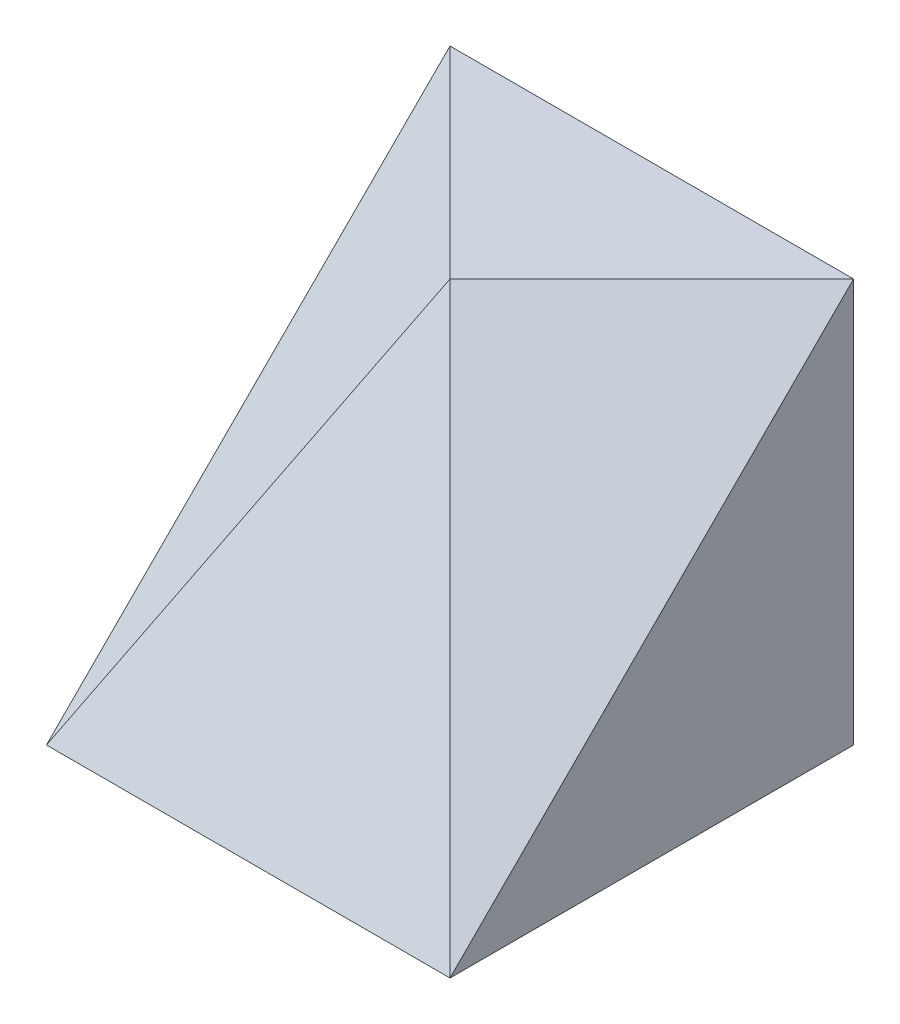
ISO-10303-21;
HEADER;
FILE_DESCRIPTION(('STEP AP214'),'2;1');
FILE_NAME('part.step','',(''),(''),'','','');
FILE_SCHEMA(('AUTOMOTIVE_DESIGN { 1 0 10303 214 1 1 1 1 }'));
ENDSEC;
DATA;
#1=APPLICATION_CONTEXT('core data for automotive mechanical design processes');
#2=APPLICATION_PROTOCOL_DEFINITION('international standard','automotive_design',2000,#1);
#3=PRODUCT_CONTEXT('',#1,'mechanical');
#4=PRODUCT('Part','Part','',(#3));
#5=PRODUCT_RELATED_PRODUCT_CATEGORY('part','',(#4));
#6=PRODUCT_DEFINITION_FORMATION('','',#4);
#7=PRODUCT_DEFINITION_CONTEXT('part definition',#1,'design');
#8=PRODUCT_DEFINITION('design','',#6,#7);
#9=PRODUCT_DEFINITION_SHAPE('','',#8);
#10=(LENGTH_UNIT() NAMED_UNIT(*) SI_UNIT(.MILLI.,.METRE.));
#11=(NAMED_UNIT(*) PLANE_ANGLE_UNIT() SI_UNIT($,.RADIAN.));
#12=(NAMED_UNIT(*) SI_UNIT($,.STERADIAN.) SOLID_ANGLE_UNIT());
#13=UNCERTAINTY_MEASURE_WITH_UNIT(LENGTH_MEASURE(1.E-05),#10,'distance_accuracy_value','');
#14=(GEOMETRIC_REPRESENTATION_CONTEXT(3) GLOBAL_UNCERTAINTY_ASSIGNED_CONTEXT((#13)) GLOBAL_UNIT_ASSIGNED_CONTEXT((#10,
#11,#12)) REPRESENTATION_CONTEXT('',''));
#15=CARTESIAN_POINT('',(0.,0.,0.));
#16=DIRECTION('',(0.,0.,1.));
#17=DIRECTION('',(1.,0.,0.));
#18=AXIS2_PLACEMENT_3D('',#15,#16,#17);
#19=CARTESIAN_POINT('',(0.,4.,0.));
#20=DIRECTION('',(0.,-1.,0.));
#21=DIRECTION('',(0.,0.,-1.));
#22=AXIS2_PLACEMENT_3D('',#19,#20,#21);
#23=PLANE('',#22);
#24=DIRECTION('',(-0.707106781186548,0.,-0.707106781186547));
#25=VECTOR('',#24,1.);
#26=CARTESIAN_POINT('',(0.,4.,0.));
#27=LINE('',#26,#25);
#28=CARTESIAN_POINT('',(0.,4.,0.));
#29=VERTEX_POINT('',#28);
#30=CARTESIAN_POINT('',(-2.00000000000001,4.,-2.00000000000001));
#31=VERTEX_POINT('',#30);
#32=EDGE_CURVE('E84',#29,#31,#27,.T.);
#33=ORIENTED_EDGE('',*,*,#32,.F.);
#34=DIRECTION('',(-0.707106781186546,0.,0.70710678118655));
#35=VECTOR('',#34,1.);
#36=CARTESIAN_POINT('',(1.99999999999999,4.,-2.00000000000001));
#37=LINE('',#36,#35);
#38=CARTESIAN_POINT('',(1.99999999999999,4.,-2.00000000000001));
#39=VERTEX_POINT('',#38);
#40=EDGE_CURVE('E107',#39,#29,#37,.T.);
#41=ORIENTED_EDGE('',*,*,#40,.F.);
#42=DIRECTION('',(-1.,0.,0.));
#43=VECTOR('',#42,1.);
#44=CARTESIAN_POINT('',(-2.00000000000001,4.,-2.00000000000001));
#45=LINE('',#44,#43);
#46=EDGE_CURVE('E98',#39,#31,#45,.T.);
#47=ORIENTED_EDGE('',*,*,#46,.T.);
#48=EDGE_LOOP('',(#33,#41,#47));
#49=FACE_BOUND('',#48,.T.);
#50=ADVANCED_FACE('F36',(#49),#23,.F.);
#51=CARTESIAN_POINT('',(-2.00000000000001,4.,2.));
#52=DIRECTION('',(1.,0.,0.));
#53=DIRECTION('',(0.,0.,-1.));
#54=AXIS2_PLACEMENT_3D('',#51,#52,#53);
#55=PLANE('',#54);
#56=DIRECTION('',(0.,-0.707106781186547,0.707106781186548));
#57=VECTOR('',#56,1.);
#58=CARTESIAN_POINT('',(-2.00000000000001,4.,-2.00000000000001));
#59=LINE('',#58,#57);
#60=CARTESIAN_POINT('',(-2.00000000000001,0.,2.));
#61=VERTEX_POINT('',#60);
#62=EDGE_CURVE('E83',#31,#61,#59,.T.);
#63=ORIENTED_EDGE('',*,*,#62,.F.);
#64=DIRECTION('',(0.,-1.,0.));
#65=VECTOR('',#64,1.);
#66=CARTESIAN_POINT('',(-2.00000000000001,4.,-2.00000000000001));
#67=LINE('',#66,#65);
#68=CARTESIAN_POINT('',(-2.00000000000001,0.,-2.00000000000001));
#69=VERTEX_POINT('',#68);
#70=EDGE_CURVE('E45',#31,#69,#67,.T.);
#71=ORIENTED_EDGE('',*,*,#70,.T.);
#72=DIRECTION('',(0.,0.,1.));
#73=VECTOR('',#72,1.);
#74=CARTESIAN_POINT('',(-2.00000000000001,0.,2.));
#75=LINE('',#74,#73);
#76=EDGE_CURVE('E93',#69,#61,#75,.T.);
#77=ORIENTED_EDGE('',*,*,#76,.T.);
#78=EDGE_LOOP('',(#63,#71,#77));
#79=FACE_BOUND('',#78,.T.);
#80=ADVANCED_FACE('F94',(#79),#55,.F.);
#81=CARTESIAN_POINT('',(1.99999999999999,4.,2.));
#82=DIRECTION('',(-1.,0.,0.));
#83=DIRECTION('',(0.,0.,1.));
#84=AXIS2_PLACEMENT_3D('',#81,#82,#83);
#85=PLANE('',#84);
#86=DIRECTION('',(0.,0.707106781186547,-0.707106781186548));
#87=VECTOR('',#86,1.);
#88=CARTESIAN_POINT('',(1.99999999999999,0.,2.));
#89=LINE('',#88,#87);
#90=CARTESIAN_POINT('',(1.99999999999999,0.,2.));
#91=VERTEX_POINT('',#90);
#92=EDGE_CURVE('E91',#91,#39,#89,.T.);
#93=ORIENTED_EDGE('',*,*,#92,.F.);
#94=DIRECTION('',(0.,0.,-1.));
#95=VECTOR('',#94,1.);
#96=CARTESIAN_POINT('',(1.99999999999999,0.,2.));
#97=LINE('',#96,#95);
#98=CARTESIAN_POINT('',(1.99999999999999,0.,-2.00000000000001));
#99=VERTEX_POINT('',#98);
#100=EDGE_CURVE('E97',#91,#99,#97,.T.);
#101=ORIENTED_EDGE('',*,*,#100,.T.);
#102=DIRECTION('',(0.,-1.,0.));
#103=VECTOR('',#102,1.);
#104=CARTESIAN_POINT('',(1.99999999999999,4.,-2.00000000000001));
#105=LINE('',#104,#103);
#106=EDGE_CURVE('E12',#39,#99,#105,.T.);
#107=ORIENTED_EDGE('',*,*,#106,.F.);
#108=EDGE_LOOP('',(#93,#101,#107));
#109=FACE_BOUND('',#108,.T.);
#110=ADVANCED_FACE('F38',(#109),#85,.F.);
#111=CARTESIAN_POINT('',(-2.00000000000001,4.,-2.00000000000001));
#112=DIRECTION('',(0.,0.,1.));
#113=DIRECTION('',(1.,0.,0.));
#114=AXIS2_PLACEMENT_3D('',#111,#112,#113);
#115=PLANE('',#114);
#116=DIRECTION('',(-1.,0.,0.));
#117=VECTOR('',#116,1.);
#118=CARTESIAN_POINT('',(-2.00000000000001,0.,-2.00000000000001));
#119=LINE('',#118,#117);
#120=EDGE_CURVE('E52',#99,#69,#119,.T.);
#121=ORIENTED_EDGE('',*,*,#120,.T.);
#122=ORIENTED_EDGE('',*,*,#70,.F.);
#123=ORIENTED_EDGE('',*,*,#46,.F.);
#124=ORIENTED_EDGE('',*,*,#106,.T.);
#125=EDGE_LOOP('',(#121,#122,#123,#124));
#126=FACE_BOUND('',#125,.T.);
#127=ADVANCED_FACE('F140',(#126),#115,.F.);
#128=CARTESIAN_POINT('',(0.,0.,0.));
#129=DIRECTION('',(0.,-1.,0.));
#130=DIRECTION('',(0.,0.,-1.));
#131=AXIS2_PLACEMENT_3D('',#128,#129,#130);
#132=PLANE('',#131);
#133=ORIENTED_EDGE('',*,*,#100,.F.);
#134=DIRECTION('',(1.,0.,0.));
#135=VECTOR('',#134,1.);
#136=CARTESIAN_POINT('',(-2.00000000000001,0.,2.));
#137=LINE('',#136,#135);
#138=EDGE_CURVE('E78',#61,#91,#137,.T.);
#139=ORIENTED_EDGE('',*,*,#138,.F.);
#140=ORIENTED_EDGE('',*,*,#76,.F.);
#141=ORIENTED_EDGE('',*,*,#120,.F.);
#142=EDGE_LOOP('',(#133,#139,#140,#141));
#143=FACE_BOUND('',#142,.T.);
#144=ADVANCED_FACE('F95',(#143),#132,.T.);
#145=CARTESIAN_POINT('',(1.33333333333333,1.33333333333333,1.33333333333333));
#146=DIRECTION('',(0.577350269189626,0.577350269189626,0.577350269189625));
#147=DIRECTION('',(-0.707106781186547,0.707106781186548,0.));
#148=AXIS2_PLACEMENT_3D('',#145,#146,#147);
#149=PLANE('',#148);
#150=ORIENTED_EDGE('',*,*,#92,.T.);
#151=ORIENTED_EDGE('',*,*,#40,.T.);
#152=DIRECTION('',(0.408248290463862,-0.816496580927727,0.408248290463863));
#153=VECTOR('',#152,1.);
#154=CARTESIAN_POINT('',(0.,4.,0.));
#155=LINE('',#154,#153);
#156=EDGE_CURVE('E80',#29,#91,#155,.T.);
#157=ORIENTED_EDGE('',*,*,#156,.T.);
#158=EDGE_LOOP('',(#150,#151,#157));
#159=FACE_BOUND('',#158,.T.);
#160=ADVANCED_FACE('F137',(#159),#149,.T.);
#161=CARTESIAN_POINT('',(-1.33333333333333,1.33333333333334,1.33333333333333));
#162=DIRECTION('',(-0.577350269189625,0.577350269189626,0.577350269189626));
#163=DIRECTION('',(0.,-0.707106781186547,0.707106781186548));
#164=AXIS2_PLACEMENT_3D('',#161,#162,#163);
#165=PLANE('',#164);
#166=ORIENTED_EDGE('',*,*,#32,.T.);
#167=ORIENTED_EDGE('',*,*,#62,.T.);
#168=DIRECTION('',(0.408248290463864,0.816496580927726,-0.408248290463863));
#169=VECTOR('',#168,1.);
#170=CARTESIAN_POINT('',(-2.00000000000001,0.,2.));
#171=LINE('',#170,#169);
#172=EDGE_CURVE('E74',#61,#29,#171,.T.);
#173=ORIENTED_EDGE('',*,*,#172,.T.);
#174=EDGE_LOOP('',(#166,#167,#173));
#175=FACE_BOUND('',#174,.T.);
#176=ADVANCED_FACE('F88',(#175),#165,.T.);
#177=CARTESIAN_POINT('',(0.,0.799999999999999,1.6));
#178=DIRECTION('',(0.,0.447213595499958,0.894427190999916));
#179=DIRECTION('',(0.,-0.894427190999916,0.447213595499958));
#180=AXIS2_PLACEMENT_3D('',#177,#178,#179);
#181=PLANE('',#180);
#182=ORIENTED_EDGE('',*,*,#138,.T.);
#183=ORIENTED_EDGE('',*,*,#156,.F.);
#184=ORIENTED_EDGE('',*,*,#172,.F.);
#185=EDGE_LOOP('',(#182,#183,#184));
#186=FACE_BOUND('',#185,.T.);
#187=ADVANCED_FACE('F76',(#186),#181,.T.);
#188=CLOSED_SHELL('',(#50,#80,#110,#127,#144,#160,#176,#187));
#189=MANIFOLD_SOLID_BREP('B2',#188);
#190=ADVANCED_BREP_SHAPE_REPRESENTATION('',(#18,#189),#14);
#191=SHAPE_DEFINITION_REPRESENTATION(#9,#190);
ENDSEC;
END-ISO-10303-21;
